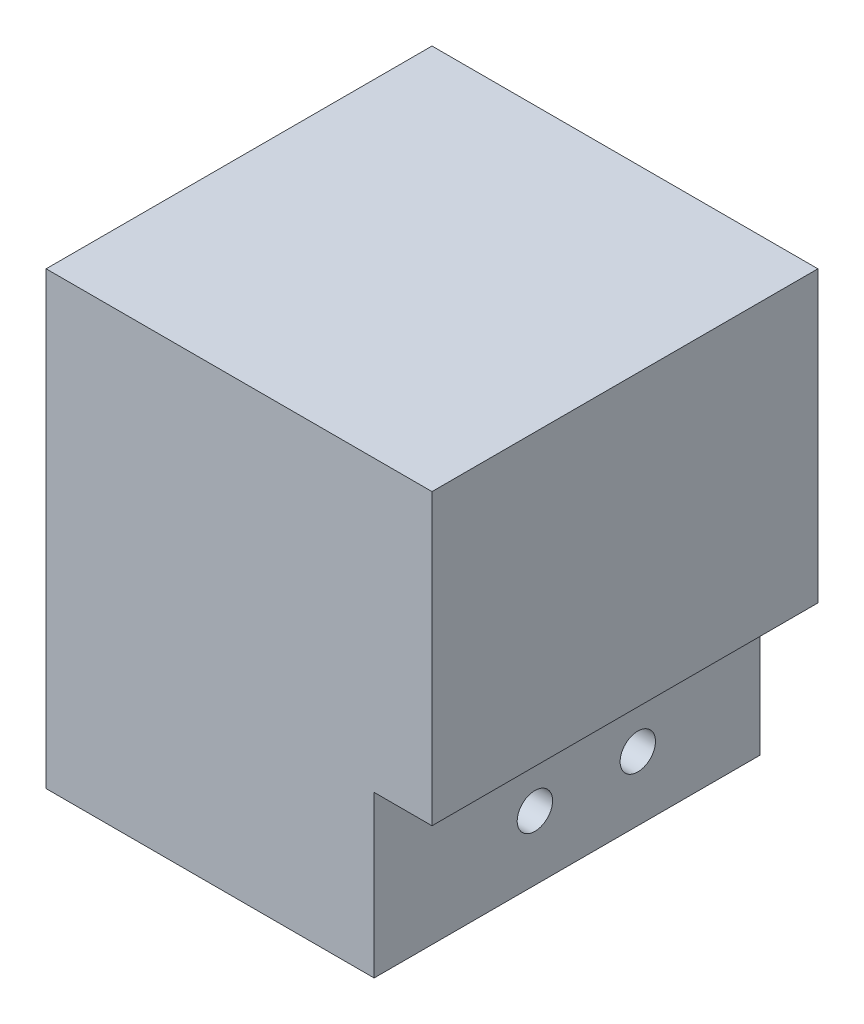
ISO-10303-21;
HEADER;
FILE_DESCRIPTION(('STEP AP214'),'2;1');
FILE_NAME('part.step','',(''),(''),'','','');
FILE_SCHEMA(('AUTOMOTIVE_DESIGN { 1 0 10303 214 1 1 1 1 }'));
ENDSEC;
DATA;
#1=APPLICATION_CONTEXT('core data for automotive mechanical design processes');
#2=APPLICATION_PROTOCOL_DEFINITION('international standard','automotive_design',2000,#1);
#3=PRODUCT_CONTEXT('',#1,'mechanical');
#4=PRODUCT('Part','Part','',(#3));
#5=PRODUCT_RELATED_PRODUCT_CATEGORY('part','',(#4));
#6=PRODUCT_DEFINITION_FORMATION('','',#4);
#7=PRODUCT_DEFINITION_CONTEXT('part definition',#1,'design');
#8=PRODUCT_DEFINITION('design','',#6,#7);
#9=PRODUCT_DEFINITION_SHAPE('','',#8);
#10=(LENGTH_UNIT() NAMED_UNIT(*) SI_UNIT(.MILLI.,.METRE.));
#11=(NAMED_UNIT(*) PLANE_ANGLE_UNIT() SI_UNIT($,.RADIAN.));
#12=(NAMED_UNIT(*) SI_UNIT($,.STERADIAN.) SOLID_ANGLE_UNIT());
#13=UNCERTAINTY_MEASURE_WITH_UNIT(LENGTH_MEASURE(1.E-05),#10,'distance_accuracy_value','');
#14=(GEOMETRIC_REPRESENTATION_CONTEXT(3) GLOBAL_UNCERTAINTY_ASSIGNED_CONTEXT((#13)) GLOBAL_UNIT_ASSIGNED_CONTEXT((#10,
#11,#12)) REPRESENTATION_CONTEXT('',''));
#15=CARTESIAN_POINT('',(0.,0.,0.));
#16=DIRECTION('',(0.,0.,1.));
#17=DIRECTION('',(1.,0.,0.));
#18=AXIS2_PLACEMENT_3D('',#15,#16,#17);
#19=CARTESIAN_POINT('',(-9.,10.,35.));
#20=DIRECTION('',(1.,0.,0.));
#21=DIRECTION('',(0.,0.,-1.));
#22=AXIS2_PLACEMENT_3D('',#19,#20,#21);
#23=CYLINDRICAL_SURFACE('',#22,2.74999999999999);
#24=CARTESIAN_POINT('',(-9.,10.,35.));
#25=DIRECTION('',(1.,0.,0.));
#26=DIRECTION('',(0.,0.,-1.));
#27=AXIS2_PLACEMENT_3D('',#24,#25,#26);
#28=CIRCLE('',#27,2.74999999999999);
#29=CARTESIAN_POINT('',(-9.,10.,32.25));
#30=VERTEX_POINT('',#29);
#31=EDGE_CURVE('E131',#30,#30,#28,.T.);
#32=ORIENTED_EDGE('',*,*,#31,.T.);
#33=EDGE_LOOP('',(#32));
#34=FACE_BOUND('',#33,.T.);
#35=CARTESIAN_POINT('',(-35.,10.,35.));
#36=DIRECTION('',(-1.,0.,0.));
#37=DIRECTION('',(0.,0.,1.));
#38=AXIS2_PLACEMENT_3D('',#35,#36,#37);
#39=CIRCLE('',#38,2.74999999999999);
#40=CARTESIAN_POINT('',(-35.,10.,37.75));
#41=VERTEX_POINT('',#40);
#42=EDGE_CURVE('E39',#41,#41,#39,.F.);
#43=ORIENTED_EDGE('',*,*,#42,.F.);
#44=EDGE_LOOP('',(#43));
#45=FACE_BOUND('',#44,.T.);
#46=ADVANCED_FACE('F35',(#34,#45),#23,.F.);
#47=CARTESIAN_POINT('',(-9.,10.,19.));
#48=DIRECTION('',(1.,0.,0.));
#49=DIRECTION('',(0.,0.,-1.));
#50=AXIS2_PLACEMENT_3D('',#47,#48,#49);
#51=CYLINDRICAL_SURFACE('',#50,2.74999999999999);
#52=CARTESIAN_POINT('',(-9.,10.,19.));
#53=DIRECTION('',(1.,0.,0.));
#54=DIRECTION('',(0.,0.,-1.));
#55=AXIS2_PLACEMENT_3D('',#52,#53,#54);
#56=CIRCLE('',#55,2.74999999999999);
#57=CARTESIAN_POINT('',(-9.,10.,16.25));
#58=VERTEX_POINT('',#57);
#59=EDGE_CURVE('E136',#58,#58,#56,.T.);
#60=ORIENTED_EDGE('',*,*,#59,.T.);
#61=EDGE_LOOP('',(#60));
#62=FACE_BOUND('',#61,.T.);
#63=CARTESIAN_POINT('',(-35.,10.,19.));
#64=DIRECTION('',(-1.,0.,0.));
#65=DIRECTION('',(0.,0.,1.));
#66=AXIS2_PLACEMENT_3D('',#63,#64,#65);
#67=CIRCLE('',#66,2.74999999999999);
#68=CARTESIAN_POINT('',(-35.,10.,21.75));
#69=VERTEX_POINT('',#68);
#70=EDGE_CURVE('E129',#69,#69,#67,.F.);
#71=ORIENTED_EDGE('',*,*,#70,.F.);
#72=EDGE_LOOP('',(#71));
#73=FACE_BOUND('',#72,.T.);
#74=ADVANCED_FACE('F176',(#62,#73),#51,.F.);
#75=CARTESIAN_POINT('',(0.,0.,60.));
#76=DIRECTION('',(0.,1.,0.));
#77=DIRECTION('',(-1.,0.,0.));
#78=AXIS2_PLACEMENT_3D('',#75,#76,#77);
#79=PLANE('',#78);
#80=DIRECTION('',(0.,0.,-1.));
#81=VECTOR('',#80,1.);
#82=CARTESIAN_POINT('',(-9.,0.,60.));
#83=LINE('',#82,#81);
#84=CARTESIAN_POINT('',(-9.,0.,60.));
#85=VERTEX_POINT('',#84);
#86=CARTESIAN_POINT('',(-9.,0.,0.));
#87=VERTEX_POINT('',#86);
#88=EDGE_CURVE('E52',#85,#87,#83,.T.);
#89=ORIENTED_EDGE('',*,*,#88,.F.);
#90=DIRECTION('',(1.,0.,0.));
#91=VECTOR('',#90,1.);
#92=CARTESIAN_POINT('',(0.,0.,60.));
#93=LINE('',#92,#91);
#94=CARTESIAN_POINT('',(-60.,0.,60.));
#95=VERTEX_POINT('',#94);
#96=EDGE_CURVE('E109',#95,#85,#93,.T.);
#97=ORIENTED_EDGE('',*,*,#96,.F.);
#98=DIRECTION('',(0.,0.,-1.));
#99=VECTOR('',#98,1.);
#100=CARTESIAN_POINT('',(-60.,0.,60.));
#101=LINE('',#100,#99);
#102=CARTESIAN_POINT('',(-60.,0.,0.));
#103=VERTEX_POINT('',#102);
#104=EDGE_CURVE('E115',#95,#103,#101,.T.);
#105=ORIENTED_EDGE('',*,*,#104,.T.);
#106=DIRECTION('',(1.,0.,0.));
#107=VECTOR('',#106,1.);
#108=CARTESIAN_POINT('',(0.,0.,0.));
#109=LINE('',#108,#107);
#110=EDGE_CURVE('E111',#103,#87,#109,.T.);
#111=ORIENTED_EDGE('',*,*,#110,.T.);
#112=EDGE_LOOP('',(#89,#97,#105,#111));
#113=FACE_BOUND('',#112,.T.);
#114=ADVANCED_FACE('F108',(#113),#79,.F.);
#115=CARTESIAN_POINT('',(0.,0.,60.));
#116=DIRECTION('',(-1.,0.,0.));
#117=DIRECTION('',(0.,0.,1.));
#118=AXIS2_PLACEMENT_3D('',#115,#116,#117);
#119=PLANE('',#118);
#120=DIRECTION('',(0.,1.,0.));
#121=VECTOR('',#120,1.);
#122=CARTESIAN_POINT('',(0.,0.,60.));
#123=LINE('',#122,#121);
#124=CARTESIAN_POINT('',(0.,25.,60.));
#125=VERTEX_POINT('',#124);
#126=CARTESIAN_POINT('',(0.,70.,60.));
#127=VERTEX_POINT('',#126);
#128=EDGE_CURVE('E83',#125,#127,#123,.T.);
#129=ORIENTED_EDGE('',*,*,#128,.F.);
#130=DIRECTION('',(0.,0.,1.));
#131=VECTOR('',#130,1.);
#132=CARTESIAN_POINT('',(0.,25.,60.));
#133=LINE('',#132,#131);
#134=CARTESIAN_POINT('',(0.,25.,0.));
#135=VERTEX_POINT('',#134);
#136=EDGE_CURVE('E103',#135,#125,#133,.T.);
#137=ORIENTED_EDGE('',*,*,#136,.F.);
#138=DIRECTION('',(0.,1.,0.));
#139=VECTOR('',#138,1.);
#140=CARTESIAN_POINT('',(0.,0.,0.));
#141=LINE('',#140,#139);
#142=CARTESIAN_POINT('',(0.,70.,0.));
#143=VERTEX_POINT('',#142);
#144=EDGE_CURVE('E122',#135,#143,#141,.T.);
#145=ORIENTED_EDGE('',*,*,#144,.T.);
#146=DIRECTION('',(0.,0.,-1.));
#147=VECTOR('',#146,1.);
#148=CARTESIAN_POINT('',(0.,70.,60.));
#149=LINE('',#148,#147);
#150=EDGE_CURVE('E11',#127,#143,#149,.T.);
#151=ORIENTED_EDGE('',*,*,#150,.F.);
#152=EDGE_LOOP('',(#129,#137,#145,#151));
#153=FACE_BOUND('',#152,.T.);
#154=ADVANCED_FACE('F37',(#153),#119,.F.);
#155=CARTESIAN_POINT('',(0.,70.,60.));
#156=DIRECTION('',(0.,-1.,0.));
#157=DIRECTION('',(1.,0.,0.));
#158=AXIS2_PLACEMENT_3D('',#155,#156,#157);
#159=PLANE('',#158);
#160=DIRECTION('',(-1.,0.,0.));
#161=VECTOR('',#160,1.);
#162=CARTESIAN_POINT('',(0.,70.,0.));
#163=LINE('',#162,#161);
#164=CARTESIAN_POINT('',(-60.,70.,0.));
#165=VERTEX_POINT('',#164);
#166=EDGE_CURVE('E124',#143,#165,#163,.T.);
#167=ORIENTED_EDGE('',*,*,#166,.T.);
#168=DIRECTION('',(0.,0.,-1.));
#169=VECTOR('',#168,1.);
#170=CARTESIAN_POINT('',(-60.,70.,60.));
#171=LINE('',#170,#169);
#172=CARTESIAN_POINT('',(-60.,70.,60.));
#173=VERTEX_POINT('',#172);
#174=EDGE_CURVE('E44',#173,#165,#171,.T.);
#175=ORIENTED_EDGE('',*,*,#174,.F.);
#176=DIRECTION('',(-1.,0.,0.));
#177=VECTOR('',#176,1.);
#178=CARTESIAN_POINT('',(0.,70.,60.));
#179=LINE('',#178,#177);
#180=EDGE_CURVE('E118',#127,#173,#179,.T.);
#181=ORIENTED_EDGE('',*,*,#180,.F.);
#182=ORIENTED_EDGE('',*,*,#150,.T.);
#183=EDGE_LOOP('',(#167,#175,#181,#182));
#184=FACE_BOUND('',#183,.T.);
#185=ADVANCED_FACE('F160',(#184),#159,.F.);
#186=CARTESIAN_POINT('',(-60.,0.,60.));
#187=DIRECTION('',(1.,0.,0.));
#188=DIRECTION('',(0.,0.,-1.));
#189=AXIS2_PLACEMENT_3D('',#186,#187,#188);
#190=PLANE('',#189);
#191=CARTESIAN_POINT('',(-60.,10.,35.));
#192=DIRECTION('',(-1.,0.,0.));
#193=DIRECTION('',(0.,0.,1.));
#194=AXIS2_PLACEMENT_3D('',#191,#192,#193);
#195=CIRCLE('',#194,6.75000000000001);
#196=CARTESIAN_POINT('',(-60.,10.,41.75));
#197=VERTEX_POINT('',#196);
#198=EDGE_CURVE('E146',#197,#197,#195,.T.);
#199=ORIENTED_EDGE('',*,*,#198,.F.);
#200=EDGE_LOOP('',(#199));
#201=FACE_BOUND('',#200,.T.);
#202=CARTESIAN_POINT('',(-60.,10.,19.));
#203=DIRECTION('',(-1.,0.,0.));
#204=DIRECTION('',(0.,0.,1.));
#205=AXIS2_PLACEMENT_3D('',#202,#203,#204);
#206=CIRCLE('',#205,6.75);
#207=CARTESIAN_POINT('',(-60.,10.,25.75));
#208=VERTEX_POINT('',#207);
#209=EDGE_CURVE('E139',#208,#208,#206,.T.);
#210=ORIENTED_EDGE('',*,*,#209,.F.);
#211=EDGE_LOOP('',(#210));
#212=FACE_BOUND('',#211,.T.);
#213=DIRECTION('',(0.,-1.,0.));
#214=VECTOR('',#213,1.);
#215=CARTESIAN_POINT('',(-60.,0.,0.));
#216=LINE('',#215,#214);
#217=EDGE_CURVE('E78',#165,#103,#216,.T.);
#218=ORIENTED_EDGE('',*,*,#217,.T.);
#219=ORIENTED_EDGE('',*,*,#104,.F.);
#220=DIRECTION('',(0.,-1.,0.));
#221=VECTOR('',#220,1.);
#222=CARTESIAN_POINT('',(-60.,0.,60.));
#223=LINE('',#222,#221);
#224=EDGE_CURVE('E61',#173,#95,#223,.T.);
#225=ORIENTED_EDGE('',*,*,#224,.F.);
#226=ORIENTED_EDGE('',*,*,#174,.T.);
#227=EDGE_LOOP('',(#218,#219,#225,#226));
#228=FACE_BOUND('',#227,.T.);
#229=ADVANCED_FACE('F162',(#201,#212,#228),#190,.F.);
#230=CARTESIAN_POINT('',(0.,0.,60.));
#231=DIRECTION('',(0.,0.,1.));
#232=DIRECTION('',(1.,0.,0.));
#233=AXIS2_PLACEMENT_3D('',#230,#231,#232);
#234=PLANE('',#233);
#235=DIRECTION('',(1.,0.,0.));
#236=VECTOR('',#235,1.);
#237=CARTESIAN_POINT('',(-9.,25.,60.));
#238=LINE('',#237,#236);
#239=CARTESIAN_POINT('',(-9.,25.,60.));
#240=VERTEX_POINT('',#239);
#241=EDGE_CURVE('E125',#240,#125,#238,.T.);
#242=ORIENTED_EDGE('',*,*,#241,.T.);
#243=ORIENTED_EDGE('',*,*,#128,.T.);
#244=ORIENTED_EDGE('',*,*,#180,.T.);
#245=ORIENTED_EDGE('',*,*,#224,.T.);
#246=ORIENTED_EDGE('',*,*,#96,.T.);
#247=DIRECTION('',(0.,-1.,0.));
#248=VECTOR('',#247,1.);
#249=CARTESIAN_POINT('',(-9.,25.,60.));
#250=LINE('',#249,#248);
#251=EDGE_CURVE('E99',#240,#85,#250,.T.);
#252=ORIENTED_EDGE('',*,*,#251,.F.);
#253=EDGE_LOOP('',(#242,#243,#244,#245,#246,#252));
#254=FACE_BOUND('',#253,.T.);
#255=ADVANCED_FACE('F114',(#254),#234,.T.);
#256=CARTESIAN_POINT('',(0.,0.,0.));
#257=DIRECTION('',(0.,0.,1.));
#258=DIRECTION('',(1.,0.,0.));
#259=AXIS2_PLACEMENT_3D('',#256,#257,#258);
#260=PLANE('',#259);
#261=ORIENTED_EDGE('',*,*,#144,.F.);
#262=DIRECTION('',(1.,0.,0.));
#263=VECTOR('',#262,1.);
#264=CARTESIAN_POINT('',(-9.,25.,0.));
#265=LINE('',#264,#263);
#266=CARTESIAN_POINT('',(-9.,25.,0.));
#267=VERTEX_POINT('',#266);
#268=EDGE_CURVE('E153',#267,#135,#265,.T.);
#269=ORIENTED_EDGE('',*,*,#268,.F.);
#270=DIRECTION('',(0.,1.,0.));
#271=VECTOR('',#270,1.);
#272=CARTESIAN_POINT('',(-9.,25.,0.));
#273=LINE('',#272,#271);
#274=EDGE_CURVE('E112',#87,#267,#273,.T.);
#275=ORIENTED_EDGE('',*,*,#274,.F.);
#276=ORIENTED_EDGE('',*,*,#110,.F.);
#277=ORIENTED_EDGE('',*,*,#217,.F.);
#278=ORIENTED_EDGE('',*,*,#166,.F.);
#279=EDGE_LOOP('',(#261,#269,#275,#276,#277,#278));
#280=FACE_BOUND('',#279,.T.);
#281=ADVANCED_FACE('F165',(#280),#260,.F.);
#282=CARTESIAN_POINT('',(-9.,25.,60.));
#283=DIRECTION('',(0.,1.,0.));
#284=DIRECTION('',(0.,0.,1.));
#285=AXIS2_PLACEMENT_3D('',#282,#283,#284);
#286=PLANE('',#285);
#287=ORIENTED_EDGE('',*,*,#136,.T.);
#288=ORIENTED_EDGE('',*,*,#241,.F.);
#289=DIRECTION('',(0.,0.,1.));
#290=VECTOR('',#289,1.);
#291=CARTESIAN_POINT('',(-9.,25.,60.));
#292=LINE('',#291,#290);
#293=EDGE_CURVE('E102',#267,#240,#292,.T.);
#294=ORIENTED_EDGE('',*,*,#293,.F.);
#295=ORIENTED_EDGE('',*,*,#268,.T.);
#296=EDGE_LOOP('',(#287,#288,#294,#295));
#297=FACE_BOUND('',#296,.T.);
#298=ADVANCED_FACE('F168',(#297),#286,.F.);
#299=CARTESIAN_POINT('',(-9.,0.,0.));
#300=DIRECTION('',(1.,0.,0.));
#301=DIRECTION('',(0.,0.,-1.));
#302=AXIS2_PLACEMENT_3D('',#299,#300,#301);
#303=PLANE('',#302);
#304=ORIENTED_EDGE('',*,*,#31,.F.);
#305=EDGE_LOOP('',(#304));
#306=FACE_BOUND('',#305,.T.);
#307=ORIENTED_EDGE('',*,*,#59,.F.);
#308=EDGE_LOOP('',(#307));
#309=FACE_BOUND('',#308,.T.);
#310=ORIENTED_EDGE('',*,*,#251,.T.);
#311=ORIENTED_EDGE('',*,*,#88,.T.);
#312=ORIENTED_EDGE('',*,*,#274,.T.);
#313=ORIENTED_EDGE('',*,*,#293,.T.);
#314=EDGE_LOOP('',(#310,#311,#312,#313));
#315=FACE_BOUND('',#314,.T.);
#316=ADVANCED_FACE('F100',(#306,#309,#315),#303,.T.);
#317=CARTESIAN_POINT('',(-35.,10.,19.));
#318=DIRECTION('',(-1.,0.,0.));
#319=DIRECTION('',(0.,0.,1.));
#320=AXIS2_PLACEMENT_3D('',#317,#318,#319);
#321=PLANE('',#320);
#322=CARTESIAN_POINT('',(-35.,10.,19.));
#323=DIRECTION('',(-1.,0.,0.));
#324=DIRECTION('',(0.,0.,1.));
#325=AXIS2_PLACEMENT_3D('',#322,#323,#324);
#326=CIRCLE('',#325,6.75);
#327=CARTESIAN_POINT('',(-35.,10.,25.75));
#328=VERTEX_POINT('',#327);
#329=EDGE_CURVE('E132',#328,#328,#326,.T.);
#330=ORIENTED_EDGE('',*,*,#329,.T.);
#331=EDGE_LOOP('',(#330));
#332=FACE_BOUND('',#331,.T.);
#333=ORIENTED_EDGE('',*,*,#70,.T.);
#334=EDGE_LOOP('',(#333));
#335=FACE_BOUND('',#334,.T.);
#336=ADVANCED_FACE('F193',(#332,#335),#321,.T.);
#337=CARTESIAN_POINT('',(-35.,10.,19.));
#338=DIRECTION('',(-1.,0.,0.));
#339=DIRECTION('',(0.,0.,1.));
#340=AXIS2_PLACEMENT_3D('',#337,#338,#339);
#341=CYLINDRICAL_SURFACE('',#340,6.75);
#342=ORIENTED_EDGE('',*,*,#329,.F.);
#343=EDGE_LOOP('',(#342));
#344=FACE_BOUND('',#343,.T.);
#345=ORIENTED_EDGE('',*,*,#209,.T.);
#346=EDGE_LOOP('',(#345));
#347=FACE_BOUND('',#346,.T.);
#348=ADVANCED_FACE('F188',(#344,#347),#341,.F.);
#349=CARTESIAN_POINT('',(-35.,10.,35.));
#350=DIRECTION('',(-1.,0.,0.));
#351=DIRECTION('',(0.,0.,1.));
#352=AXIS2_PLACEMENT_3D('',#349,#350,#351);
#353=PLANE('',#352);
#354=CARTESIAN_POINT('',(-35.,10.,35.));
#355=DIRECTION('',(-1.,0.,0.));
#356=DIRECTION('',(0.,0.,1.));
#357=AXIS2_PLACEMENT_3D('',#354,#355,#356);
#358=CIRCLE('',#357,6.75000000000001);
#359=CARTESIAN_POINT('',(-35.,10.,41.75));
#360=VERTEX_POINT('',#359);
#361=EDGE_CURVE('E230',#360,#360,#358,.T.);
#362=ORIENTED_EDGE('',*,*,#361,.T.);
#363=EDGE_LOOP('',(#362));
#364=FACE_BOUND('',#363,.T.);
#365=ORIENTED_EDGE('',*,*,#42,.T.);
#366=EDGE_LOOP('',(#365));
#367=FACE_BOUND('',#366,.T.);
#368=ADVANCED_FACE('F211',(#364,#367),#353,.T.);
#369=CARTESIAN_POINT('',(-35.,10.,35.));
#370=DIRECTION('',(-1.,0.,0.));
#371=DIRECTION('',(0.,0.,1.));
#372=AXIS2_PLACEMENT_3D('',#369,#370,#371);
#373=CYLINDRICAL_SURFACE('',#372,6.75000000000001);
#374=ORIENTED_EDGE('',*,*,#361,.F.);
#375=EDGE_LOOP('',(#374));
#376=FACE_BOUND('',#375,.T.);
#377=ORIENTED_EDGE('',*,*,#198,.T.);
#378=EDGE_LOOP('',(#377));
#379=FACE_BOUND('',#378,.T.);
#380=ADVANCED_FACE('F217',(#376,#379),#373,.F.);
#381=CLOSED_SHELL('',(#46,#74,#114,#154,#185,#229,#255,#281,#298,#316,#336,#348,#368,#380));
#382=MANIFOLD_SOLID_BREP('B2',#381);
#383=ADVANCED_BREP_SHAPE_REPRESENTATION('',(#18,#382),#14);
#384=SHAPE_DEFINITION_REPRESENTATION(#9,#383);
ENDSEC;
END-ISO-10303-21;
